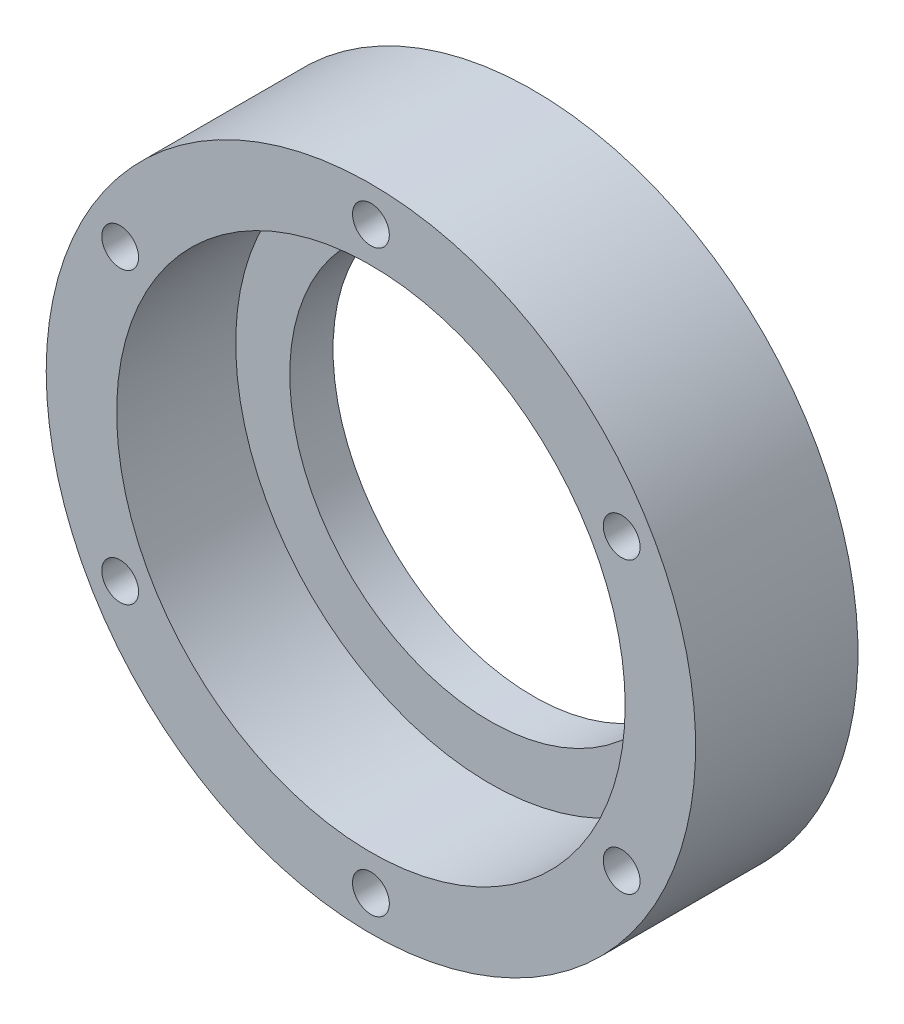
ISO-10303-21;
HEADER;
FILE_DESCRIPTION(('STEP AP214'),'2;1');
FILE_NAME('part.step','',(''),(''),'','','');
FILE_SCHEMA(('AUTOMOTIVE_DESIGN { 1 0 10303 214 1 1 1 1 }'));
ENDSEC;
DATA;
#1=APPLICATION_CONTEXT('core data for automotive mechanical design processes');
#2=APPLICATION_PROTOCOL_DEFINITION('international standard','automotive_design',2000,#1);
#3=PRODUCT_CONTEXT('',#1,'mechanical');
#4=PRODUCT('Part','Part','',(#3));
#5=PRODUCT_RELATED_PRODUCT_CATEGORY('part','',(#4));
#6=PRODUCT_DEFINITION_FORMATION('','',#4);
#7=PRODUCT_DEFINITION_CONTEXT('part definition',#1,'design');
#8=PRODUCT_DEFINITION('design','',#6,#7);
#9=PRODUCT_DEFINITION_SHAPE('','',#8);
#10=(LENGTH_UNIT() NAMED_UNIT(*) SI_UNIT(.MILLI.,.METRE.));
#11=(NAMED_UNIT(*) PLANE_ANGLE_UNIT() SI_UNIT($,.RADIAN.));
#12=(NAMED_UNIT(*) SI_UNIT($,.STERADIAN.) SOLID_ANGLE_UNIT());
#13=UNCERTAINTY_MEASURE_WITH_UNIT(LENGTH_MEASURE(1.E-05),#10,'distance_accuracy_value','');
#14=(GEOMETRIC_REPRESENTATION_CONTEXT(3) GLOBAL_UNCERTAINTY_ASSIGNED_CONTEXT((#13)) GLOBAL_UNIT_ASSIGNED_CONTEXT((#10,
#11,#12)) REPRESENTATION_CONTEXT('',''));
#15=CARTESIAN_POINT('',(0.,0.,0.));
#16=DIRECTION('',(0.,0.,1.));
#17=DIRECTION('',(1.,0.,0.));
#18=AXIS2_PLACEMENT_3D('',#15,#16,#17);
#19=CARTESIAN_POINT('',(0.,0.,15.));
#20=DIRECTION('',(0.,0.,-1.));
#21=DIRECTION('',(-1.,0.,0.));
#22=AXIS2_PLACEMENT_3D('',#19,#20,#21);
#23=CYLINDRICAL_SURFACE('',#22,30.);
#24=CARTESIAN_POINT('',(0.,0.,15.));
#25=DIRECTION('',(0.,0.,-1.));
#26=DIRECTION('',(-1.,0.,0.));
#27=AXIS2_PLACEMENT_3D('',#24,#25,#26);
#28=CIRCLE('',#27,30.);
#29=CARTESIAN_POINT('',(-30.,0.,15.));
#30=VERTEX_POINT('',#29);
#31=EDGE_CURVE('E77',#30,#30,#28,.T.);
#32=ORIENTED_EDGE('',*,*,#31,.T.);
#33=EDGE_LOOP('',(#32));
#34=FACE_BOUND('',#33,.T.);
#35=CARTESIAN_POINT('',(0.,0.,0.));
#36=DIRECTION('',(0.,0.,-1.));
#37=DIRECTION('',(-1.,0.,0.));
#38=AXIS2_PLACEMENT_3D('',#35,#36,#37);
#39=CIRCLE('',#38,30.);
#40=CARTESIAN_POINT('',(-30.,0.,0.));
#41=VERTEX_POINT('',#40);
#42=EDGE_CURVE('E80',#41,#41,#39,.T.);
#43=ORIENTED_EDGE('',*,*,#42,.F.);
#44=EDGE_LOOP('',(#43));
#45=FACE_BOUND('',#44,.T.);
#46=ADVANCED_FACE('F33',(#34,#45),#23,.T.);
#47=CARTESIAN_POINT('',(30.,0.,15.));
#48=DIRECTION('',(0.,0.,1.));
#49=DIRECTION('',(1.,0.,0.));
#50=AXIS2_PLACEMENT_3D('',#47,#48,#49);
#51=PLANE('',#50);
#52=CARTESIAN_POINT('',(0.,0.,15.));
#53=DIRECTION('',(0.,0.,1.));
#54=DIRECTION('',(1.,0.,0.));
#55=AXIS2_PLACEMENT_3D('',#52,#53,#54);
#56=CIRCLE('',#55,23.49119);
#57=CARTESIAN_POINT('',(23.49119,0.,15.));
#58=VERTEX_POINT('',#57);
#59=EDGE_CURVE('E110',#58,#58,#56,.T.);
#60=ORIENTED_EDGE('',*,*,#59,.F.);
#61=EDGE_LOOP('',(#60));
#62=FACE_BOUND('',#61,.T.);
#63=CARTESIAN_POINT('',(23.166179551236,-13.3749999999987,15.));
#64=DIRECTION('',(0.,0.,-1.));
#65=DIRECTION('',(-1.,0.,0.));
#66=AXIS2_PLACEMENT_3D('',#63,#64,#65);
#67=CIRCLE('',#66,1.69999999999999);
#68=CARTESIAN_POINT('',(21.466179551236,-13.3749999999987,15.));
#69=VERTEX_POINT('',#68);
#70=EDGE_CURVE('E98',#69,#69,#67,.T.);
#71=ORIENTED_EDGE('',*,*,#70,.T.);
#72=EDGE_LOOP('',(#71));
#73=FACE_BOUND('',#72,.T.);
#74=CARTESIAN_POINT('',(23.1661795512345,13.3750000000013,15.));
#75=DIRECTION('',(0.,0.,-1.));
#76=DIRECTION('',(-1.,0.,0.));
#77=AXIS2_PLACEMENT_3D('',#74,#75,#76);
#78=CIRCLE('',#77,1.69999999999999);
#79=CARTESIAN_POINT('',(21.4661795512345,13.3750000000013,15.));
#80=VERTEX_POINT('',#79);
#81=EDGE_CURVE('E95',#80,#80,#78,.T.);
#82=ORIENTED_EDGE('',*,*,#81,.T.);
#83=EDGE_LOOP('',(#82));
#84=FACE_BOUND('',#83,.T.);
#85=CARTESIAN_POINT('',(0.,26.75,15.));
#86=DIRECTION('',(0.,0.,-1.));
#87=DIRECTION('',(-1.,0.,0.));
#88=AXIS2_PLACEMENT_3D('',#85,#86,#87);
#89=CIRCLE('',#88,1.69999999999999);
#90=CARTESIAN_POINT('',(-1.69999999999999,26.75,15.));
#91=VERTEX_POINT('',#90);
#92=EDGE_CURVE('E92',#91,#91,#89,.T.);
#93=ORIENTED_EDGE('',*,*,#92,.T.);
#94=EDGE_LOOP('',(#93));
#95=FACE_BOUND('',#94,.T.);
#96=CARTESIAN_POINT('',(-23.1661795512315,-13.3750000000013,15.));
#97=DIRECTION('',(0.,0.,-1.));
#98=DIRECTION('',(-1.,0.,0.));
#99=AXIS2_PLACEMENT_3D('',#96,#97,#98);
#100=CIRCLE('',#99,1.69999999999999);
#101=CARTESIAN_POINT('',(-24.8661795512314,-13.3750000000013,15.));
#102=VERTEX_POINT('',#101);
#103=EDGE_CURVE('E89',#102,#102,#100,.T.);
#104=ORIENTED_EDGE('',*,*,#103,.T.);
#105=EDGE_LOOP('',(#104));
#106=FACE_BOUND('',#105,.T.);
#107=CARTESIAN_POINT('',(3.03457104867779E-12,-26.75,15.));
#108=DIRECTION('',(0.,0.,-1.));
#109=DIRECTION('',(-1.,0.,0.));
#110=AXIS2_PLACEMENT_3D('',#107,#108,#109);
#111=CIRCLE('',#110,1.69999999999999);
#112=CARTESIAN_POINT('',(-1.69999999999695,-26.75,15.));
#113=VERTEX_POINT('',#112);
#114=EDGE_CURVE('E86',#113,#113,#111,.T.);
#115=ORIENTED_EDGE('',*,*,#114,.T.);
#116=EDGE_LOOP('',(#115));
#117=FACE_BOUND('',#116,.T.);
#118=CARTESIAN_POINT('',(-23.166179551233,13.3749999999987,15.));
#119=DIRECTION('',(0.,0.,-1.));
#120=DIRECTION('',(-1.,0.,0.));
#121=AXIS2_PLACEMENT_3D('',#118,#119,#120);
#122=CIRCLE('',#121,1.69999999999999);
#123=CARTESIAN_POINT('',(-24.866179551233,13.3749999999987,15.));
#124=VERTEX_POINT('',#123);
#125=EDGE_CURVE('E83',#124,#124,#122,.T.);
#126=ORIENTED_EDGE('',*,*,#125,.T.);
#127=EDGE_LOOP('',(#126));
#128=FACE_BOUND('',#127,.T.);
#129=ORIENTED_EDGE('',*,*,#31,.F.);
#130=EDGE_LOOP('',(#129));
#131=FACE_BOUND('',#130,.T.);
#132=ADVANCED_FACE('F116',(#62,#73,#84,#95,#106,#117,#128,#131),#51,.T.);
#133=CARTESIAN_POINT('',(0.,0.,0.));
#134=DIRECTION('',(0.,0.,-1.));
#135=DIRECTION('',(-1.,0.,0.));
#136=AXIS2_PLACEMENT_3D('',#133,#134,#135);
#137=PLANE('',#136);
#138=CARTESIAN_POINT('',(-23.1661795512315,-13.3750000000013,0.));
#139=DIRECTION('',(0.,0.,-1.));
#140=DIRECTION('',(-1.,0.,0.));
#141=AXIS2_PLACEMENT_3D('',#138,#139,#140);
#142=CIRCLE('',#141,3.15000000006234);
#143=CARTESIAN_POINT('',(-26.3161795512938,-13.3750000000013,0.));
#144=VERTEX_POINT('',#143);
#145=EDGE_CURVE('E56',#144,#144,#142,.F.);
#146=ORIENTED_EDGE('',*,*,#145,.T.);
#147=EDGE_LOOP('',(#146));
#148=FACE_BOUND('',#147,.T.);
#149=CARTESIAN_POINT('',(-23.166179551233,13.3749999999987,0.));
#150=DIRECTION('',(0.,0.,-1.));
#151=DIRECTION('',(-1.,0.,0.));
#152=AXIS2_PLACEMENT_3D('',#149,#150,#151);
#153=CIRCLE('',#152,3.15000000006234);
#154=CARTESIAN_POINT('',(-26.3161795512953,13.3749999999987,0.));
#155=VERTEX_POINT('',#154);
#156=EDGE_CURVE('E59',#155,#155,#153,.F.);
#157=ORIENTED_EDGE('',*,*,#156,.T.);
#158=EDGE_LOOP('',(#157));
#159=FACE_BOUND('',#158,.T.);
#160=CARTESIAN_POINT('',(3.03457104867779E-12,-26.75,0.));
#161=DIRECTION('',(0.,0.,-1.));
#162=DIRECTION('',(-1.,0.,0.));
#163=AXIS2_PLACEMENT_3D('',#160,#161,#162);
#164=CIRCLE('',#163,3.15000000006234);
#165=CARTESIAN_POINT('',(-3.1500000000593,-26.75,0.));
#166=VERTEX_POINT('',#165);
#167=EDGE_CURVE('E62',#166,#166,#164,.F.);
#168=ORIENTED_EDGE('',*,*,#167,.T.);
#169=EDGE_LOOP('',(#168));
#170=FACE_BOUND('',#169,.T.);
#171=CARTESIAN_POINT('',(23.1661795512345,13.3750000000013,0.));
#172=DIRECTION('',(0.,0.,-1.));
#173=DIRECTION('',(-1.,0.,0.));
#174=AXIS2_PLACEMENT_3D('',#171,#172,#173);
#175=CIRCLE('',#174,3.15000000006235);
#176=CARTESIAN_POINT('',(20.0161795511721,13.3750000000013,0.));
#177=VERTEX_POINT('',#176);
#178=EDGE_CURVE('E65',#177,#177,#175,.F.);
#179=ORIENTED_EDGE('',*,*,#178,.T.);
#180=EDGE_LOOP('',(#179));
#181=FACE_BOUND('',#180,.T.);
#182=CARTESIAN_POINT('',(23.166179551236,-13.3749999999987,0.));
#183=DIRECTION('',(0.,0.,-1.));
#184=DIRECTION('',(-1.,0.,0.));
#185=AXIS2_PLACEMENT_3D('',#182,#183,#184);
#186=CIRCLE('',#185,3.15000000006235);
#187=CARTESIAN_POINT('',(20.0161795511737,-13.3749999999987,0.));
#188=VERTEX_POINT('',#187);
#189=EDGE_CURVE('E68',#188,#188,#186,.F.);
#190=ORIENTED_EDGE('',*,*,#189,.T.);
#191=EDGE_LOOP('',(#190));
#192=FACE_BOUND('',#191,.T.);
#193=CARTESIAN_POINT('',(0.,26.75,0.));
#194=DIRECTION('',(0.,0.,-1.));
#195=DIRECTION('',(-1.,0.,0.));
#196=AXIS2_PLACEMENT_3D('',#193,#194,#195);
#197=CIRCLE('',#196,3.15000000006235);
#198=CARTESIAN_POINT('',(-3.15000000006235,26.75,0.));
#199=VERTEX_POINT('',#198);
#200=EDGE_CURVE('E71',#199,#199,#197,.F.);
#201=ORIENTED_EDGE('',*,*,#200,.T.);
#202=EDGE_LOOP('',(#201));
#203=FACE_BOUND('',#202,.T.);
#204=CARTESIAN_POINT('',(0.,0.,0.));
#205=DIRECTION('',(0.,0.,1.));
#206=DIRECTION('',(1.,0.,0.));
#207=AXIS2_PLACEMENT_3D('',#204,#205,#206);
#208=CIRCLE('',#207,18.5);
#209=CARTESIAN_POINT('',(18.5,0.,0.));
#210=VERTEX_POINT('',#209);
#211=EDGE_CURVE('E101',#210,#210,#208,.T.);
#212=ORIENTED_EDGE('',*,*,#211,.T.);
#213=EDGE_LOOP('',(#212));
#214=FACE_BOUND('',#213,.T.);
#215=ORIENTED_EDGE('',*,*,#42,.T.);
#216=EDGE_LOOP('',(#215));
#217=FACE_BOUND('',#216,.T.);
#218=ADVANCED_FACE('F119',(#148,#159,#170,#181,#192,#203,#214,#217),#137,.T.);
#219=CARTESIAN_POINT('',(-23.166179551233,13.3749999999987,0.));
#220=DIRECTION('',(0.,0.,-1.));
#221=DIRECTION('',(-1.,0.,0.));
#222=AXIS2_PLACEMENT_3D('',#219,#220,#221);
#223=CYLINDRICAL_SURFACE('',#222,1.69999999999999);
#224=CARTESIAN_POINT('',(-23.166179551233,13.3749999999987,1.45000000006235));
#225=DIRECTION('',(0.,0.,-1.));
#226=DIRECTION('',(-1.,0.,0.));
#227=AXIS2_PLACEMENT_3D('',#224,#225,#226);
#228=CIRCLE('',#227,1.69999999999999);
#229=CARTESIAN_POINT('',(-24.866179551233,13.3749999999987,1.45000000006235));
#230=VERTEX_POINT('',#229);
#231=EDGE_CURVE('E53',#230,#230,#228,.T.);
#232=ORIENTED_EDGE('',*,*,#231,.T.);
#233=EDGE_LOOP('',(#232));
#234=FACE_BOUND('',#233,.T.);
#235=ORIENTED_EDGE('',*,*,#125,.F.);
#236=EDGE_LOOP('',(#235));
#237=FACE_BOUND('',#236,.T.);
#238=ADVANCED_FACE('F141',(#234,#237),#223,.F.);
#239=CARTESIAN_POINT('',(3.03457104867779E-12,-26.75,0.));
#240=DIRECTION('',(0.,0.,-1.));
#241=DIRECTION('',(-1.,0.,0.));
#242=AXIS2_PLACEMENT_3D('',#239,#240,#241);
#243=CYLINDRICAL_SURFACE('',#242,1.69999999999999);
#244=CARTESIAN_POINT('',(3.03457104867779E-12,-26.75,1.45000000006234));
#245=DIRECTION('',(0.,0.,-1.));
#246=DIRECTION('',(-1.,0.,0.));
#247=AXIS2_PLACEMENT_3D('',#244,#245,#246);
#248=CIRCLE('',#247,1.69999999999999);
#249=CARTESIAN_POINT('',(-1.69999999999695,-26.75,1.45000000006234));
#250=VERTEX_POINT('',#249);
#251=EDGE_CURVE('E48',#250,#250,#248,.T.);
#252=ORIENTED_EDGE('',*,*,#251,.T.);
#253=EDGE_LOOP('',(#252));
#254=FACE_BOUND('',#253,.T.);
#255=ORIENTED_EDGE('',*,*,#114,.F.);
#256=EDGE_LOOP('',(#255));
#257=FACE_BOUND('',#256,.T.);
#258=ADVANCED_FACE('F147',(#254,#257),#243,.F.);
#259=CARTESIAN_POINT('',(-23.1661795512315,-13.3750000000013,0.));
#260=DIRECTION('',(0.,0.,-1.));
#261=DIRECTION('',(-1.,0.,0.));
#262=AXIS2_PLACEMENT_3D('',#259,#260,#261);
#263=CYLINDRICAL_SURFACE('',#262,1.69999999999999);
#264=CARTESIAN_POINT('',(-23.1661795512315,-13.3750000000013,1.45000000006235));
#265=DIRECTION('',(0.,0.,-1.));
#266=DIRECTION('',(-1.,0.,0.));
#267=AXIS2_PLACEMENT_3D('',#264,#265,#266);
#268=CIRCLE('',#267,1.69999999999999);
#269=CARTESIAN_POINT('',(-24.8661795512314,-13.3750000000013,1.45000000006235));
#270=VERTEX_POINT('',#269);
#271=EDGE_CURVE('E74',#270,#270,#268,.T.);
#272=ORIENTED_EDGE('',*,*,#271,.T.);
#273=EDGE_LOOP('',(#272));
#274=FACE_BOUND('',#273,.T.);
#275=ORIENTED_EDGE('',*,*,#103,.F.);
#276=EDGE_LOOP('',(#275));
#277=FACE_BOUND('',#276,.T.);
#278=ADVANCED_FACE('F210',(#274,#277),#263,.F.);
#279=CARTESIAN_POINT('',(0.,26.75,0.));
#280=DIRECTION('',(0.,0.,-1.));
#281=DIRECTION('',(-1.,0.,0.));
#282=AXIS2_PLACEMENT_3D('',#279,#280,#281);
#283=CYLINDRICAL_SURFACE('',#282,1.69999999999999);
#284=CARTESIAN_POINT('',(0.,26.75,1.45000000006235));
#285=DIRECTION('',(0.,0.,-1.));
#286=DIRECTION('',(-1.,0.,0.));
#287=AXIS2_PLACEMENT_3D('',#284,#285,#286);
#288=CIRCLE('',#287,1.69999999999999);
#289=CARTESIAN_POINT('',(-1.69999999999999,26.75,1.45000000006235));
#290=VERTEX_POINT('',#289);
#291=EDGE_CURVE('E10',#290,#290,#288,.T.);
#292=ORIENTED_EDGE('',*,*,#291,.T.);
#293=EDGE_LOOP('',(#292));
#294=FACE_BOUND('',#293,.T.);
#295=ORIENTED_EDGE('',*,*,#92,.F.);
#296=EDGE_LOOP('',(#295));
#297=FACE_BOUND('',#296,.T.);
#298=ADVANCED_FACE('F206',(#294,#297),#283,.F.);
#299=CARTESIAN_POINT('',(23.1661795512345,13.3750000000013,0.));
#300=DIRECTION('',(0.,0.,-1.));
#301=DIRECTION('',(-1.,0.,0.));
#302=AXIS2_PLACEMENT_3D('',#299,#300,#301);
#303=CYLINDRICAL_SURFACE('',#302,1.69999999999999);
#304=CARTESIAN_POINT('',(23.1661795512345,13.3750000000013,1.45000000006235));
#305=DIRECTION('',(0.,0.,-1.));
#306=DIRECTION('',(-1.,0.,0.));
#307=AXIS2_PLACEMENT_3D('',#304,#305,#306);
#308=CIRCLE('',#307,1.69999999999999);
#309=CARTESIAN_POINT('',(21.4661795512345,13.3750000000013,1.45000000006235));
#310=VERTEX_POINT('',#309);
#311=EDGE_CURVE('E44',#310,#310,#308,.T.);
#312=ORIENTED_EDGE('',*,*,#311,.T.);
#313=EDGE_LOOP('',(#312));
#314=FACE_BOUND('',#313,.T.);
#315=ORIENTED_EDGE('',*,*,#81,.F.);
#316=EDGE_LOOP('',(#315));
#317=FACE_BOUND('',#316,.T.);
#318=ADVANCED_FACE('F203',(#314,#317),#303,.F.);
#319=CARTESIAN_POINT('',(23.166179551236,-13.3749999999987,0.));
#320=DIRECTION('',(0.,0.,-1.));
#321=DIRECTION('',(-1.,0.,0.));
#322=AXIS2_PLACEMENT_3D('',#319,#320,#321);
#323=CYLINDRICAL_SURFACE('',#322,1.69999999999999);
#324=CARTESIAN_POINT('',(23.166179551236,-13.3749999999987,1.45000000006235));
#325=DIRECTION('',(0.,0.,-1.));
#326=DIRECTION('',(-1.,0.,0.));
#327=AXIS2_PLACEMENT_3D('',#324,#325,#326);
#328=CIRCLE('',#327,1.69999999999999);
#329=CARTESIAN_POINT('',(21.466179551236,-13.3749999999987,1.45000000006235));
#330=VERTEX_POINT('',#329);
#331=EDGE_CURVE('E40',#330,#330,#328,.T.);
#332=ORIENTED_EDGE('',*,*,#331,.T.);
#333=EDGE_LOOP('',(#332));
#334=FACE_BOUND('',#333,.T.);
#335=ORIENTED_EDGE('',*,*,#70,.F.);
#336=EDGE_LOOP('',(#335));
#337=FACE_BOUND('',#336,.T.);
#338=ADVANCED_FACE('F187',(#334,#337),#323,.F.);
#339=CARTESIAN_POINT('',(0.,0.,15.));
#340=DIRECTION('',(0.,0.,1.));
#341=DIRECTION('',(1.,0.,0.));
#342=AXIS2_PLACEMENT_3D('',#339,#340,#341);
#343=CYLINDRICAL_SURFACE('',#342,18.5);
#344=ORIENTED_EDGE('',*,*,#211,.F.);
#345=EDGE_LOOP('',(#344));
#346=FACE_BOUND('',#345,.T.);
#347=CARTESIAN_POINT('',(0.,0.,4.));
#348=DIRECTION('',(0.,0.,1.));
#349=DIRECTION('',(1.,0.,0.));
#350=AXIS2_PLACEMENT_3D('',#347,#348,#349);
#351=CIRCLE('',#350,18.5);
#352=CARTESIAN_POINT('',(18.5,0.,4.));
#353=VERTEX_POINT('',#352);
#354=EDGE_CURVE('E104',#353,#353,#351,.T.);
#355=ORIENTED_EDGE('',*,*,#354,.T.);
#356=EDGE_LOOP('',(#355));
#357=FACE_BOUND('',#356,.T.);
#358=ADVANCED_FACE('F183',(#346,#357),#343,.F.);
#359=CARTESIAN_POINT('',(18.5,0.,4.));
#360=DIRECTION('',(0.,0.,-1.));
#361=DIRECTION('',(-1.,0.,0.));
#362=AXIS2_PLACEMENT_3D('',#359,#360,#361);
#363=PLANE('',#362);
#364=ORIENTED_EDGE('',*,*,#354,.F.);
#365=EDGE_LOOP('',(#364));
#366=FACE_BOUND('',#365,.T.);
#367=CARTESIAN_POINT('',(0.,0.,4.));
#368=DIRECTION('',(0.,0.,1.));
#369=DIRECTION('',(1.,0.,0.));
#370=AXIS2_PLACEMENT_3D('',#367,#368,#369);
#371=CIRCLE('',#370,23.49119);
#372=CARTESIAN_POINT('',(23.49119,0.,4.));
#373=VERTEX_POINT('',#372);
#374=EDGE_CURVE('E107',#373,#373,#371,.T.);
#375=ORIENTED_EDGE('',*,*,#374,.T.);
#376=EDGE_LOOP('',(#375));
#377=FACE_BOUND('',#376,.T.);
#378=ADVANCED_FACE('F186',(#366,#377),#363,.F.);
#379=CARTESIAN_POINT('',(0.,0.,15.));
#380=DIRECTION('',(0.,0.,1.));
#381=DIRECTION('',(1.,0.,0.));
#382=AXIS2_PLACEMENT_3D('',#379,#380,#381);
#383=CYLINDRICAL_SURFACE('',#382,23.49119);
#384=ORIENTED_EDGE('',*,*,#374,.F.);
#385=EDGE_LOOP('',(#384));
#386=FACE_BOUND('',#385,.T.);
#387=ORIENTED_EDGE('',*,*,#59,.T.);
#388=EDGE_LOOP('',(#387));
#389=FACE_BOUND('',#388,.T.);
#390=ADVANCED_FACE('F114',(#386,#389),#383,.F.);
#391=CARTESIAN_POINT('',(-23.1661795512315,-13.3750000000013,1.45000000006235));
#392=DIRECTION('',(0.,0.,-1.));
#393=DIRECTION('',(-1.,0.,0.));
#394=AXIS2_PLACEMENT_3D('',#391,#392,#393);
#395=CONICAL_SURFACE('',#394,1.69999999999999,0.78539816339745);
#396=ORIENTED_EDGE('',*,*,#145,.F.);
#397=EDGE_LOOP('',(#396));
#398=FACE_BOUND('',#397,.T.);
#399=ORIENTED_EDGE('',*,*,#271,.F.);
#400=EDGE_LOOP('',(#399));
#401=FACE_BOUND('',#400,.T.);
#402=ADVANCED_FACE('F153',(#398,#401),#395,.F.);
#403=CARTESIAN_POINT('',(-23.166179551233,13.3749999999987,1.45000000006235));
#404=DIRECTION('',(0.,0.,-1.));
#405=DIRECTION('',(-1.,0.,0.));
#406=AXIS2_PLACEMENT_3D('',#403,#404,#405);
#407=CONICAL_SURFACE('',#406,1.69999999999999,0.78539816339745);
#408=ORIENTED_EDGE('',*,*,#156,.F.);
#409=EDGE_LOOP('',(#408));
#410=FACE_BOUND('',#409,.T.);
#411=ORIENTED_EDGE('',*,*,#231,.F.);
#412=EDGE_LOOP('',(#411));
#413=FACE_BOUND('',#412,.T.);
#414=ADVANCED_FACE('F156',(#410,#413),#407,.F.);
#415=CARTESIAN_POINT('',(3.03457104867779E-12,-26.75,1.45000000006234));
#416=DIRECTION('',(0.,0.,-1.));
#417=DIRECTION('',(-1.,0.,0.));
#418=AXIS2_PLACEMENT_3D('',#415,#416,#417);
#419=CONICAL_SURFACE('',#418,1.69999999999999,0.785398163397454);
#420=ORIENTED_EDGE('',*,*,#167,.F.);
#421=EDGE_LOOP('',(#420));
#422=FACE_BOUND('',#421,.T.);
#423=ORIENTED_EDGE('',*,*,#251,.F.);
#424=EDGE_LOOP('',(#423));
#425=FACE_BOUND('',#424,.T.);
#426=ADVANCED_FACE('F160',(#422,#425),#419,.F.);
#427=CARTESIAN_POINT('',(23.1661795512345,13.3750000000013,1.45000000006235));
#428=DIRECTION('',(0.,0.,-1.));
#429=DIRECTION('',(-1.,0.,0.));
#430=AXIS2_PLACEMENT_3D('',#427,#428,#429);
#431=CONICAL_SURFACE('',#430,1.69999999999999,0.785398163397451);
#432=ORIENTED_EDGE('',*,*,#178,.F.);
#433=EDGE_LOOP('',(#432));
#434=FACE_BOUND('',#433,.T.);
#435=ORIENTED_EDGE('',*,*,#311,.F.);
#436=EDGE_LOOP('',(#435));
#437=FACE_BOUND('',#436,.T.);
#438=ADVANCED_FACE('F164',(#434,#437),#431,.F.);
#439=CARTESIAN_POINT('',(23.166179551236,-13.3749999999987,1.45000000006235));
#440=DIRECTION('',(0.,0.,-1.));
#441=DIRECTION('',(-1.,0.,0.));
#442=AXIS2_PLACEMENT_3D('',#439,#440,#441);
#443=CONICAL_SURFACE('',#442,1.69999999999999,0.785398163397451);
#444=ORIENTED_EDGE('',*,*,#189,.F.);
#445=EDGE_LOOP('',(#444));
#446=FACE_BOUND('',#445,.T.);
#447=ORIENTED_EDGE('',*,*,#331,.F.);
#448=EDGE_LOOP('',(#447));
#449=FACE_BOUND('',#448,.T.);
#450=ADVANCED_FACE('F167',(#446,#449),#443,.F.);
#451=CARTESIAN_POINT('',(0.,26.75,1.45000000006235));
#452=DIRECTION('',(0.,0.,-1.));
#453=DIRECTION('',(-1.,0.,0.));
#454=AXIS2_PLACEMENT_3D('',#451,#452,#453);
#455=CONICAL_SURFACE('',#454,1.69999999999999,0.785398163397454);
#456=ORIENTED_EDGE('',*,*,#200,.F.);
#457=EDGE_LOOP('',(#456));
#458=FACE_BOUND('',#457,.T.);
#459=ORIENTED_EDGE('',*,*,#291,.F.);
#460=EDGE_LOOP('',(#459));
#461=FACE_BOUND('',#460,.T.);
#462=ADVANCED_FACE('F35',(#458,#461),#455,.F.);
#463=CLOSED_SHELL('',(#46,#132,#218,#238,#258,#278,#298,#318,#338,#358,#378,#390,#402,#414,#426,
#438,#450,#462));
#464=MANIFOLD_SOLID_BREP('B2',#463);
#465=ADVANCED_BREP_SHAPE_REPRESENTATION('',(#18,#464),#14);
#466=SHAPE_DEFINITION_REPRESENTATION(#9,#465);
ENDSEC;
END-ISO-10303-21;
